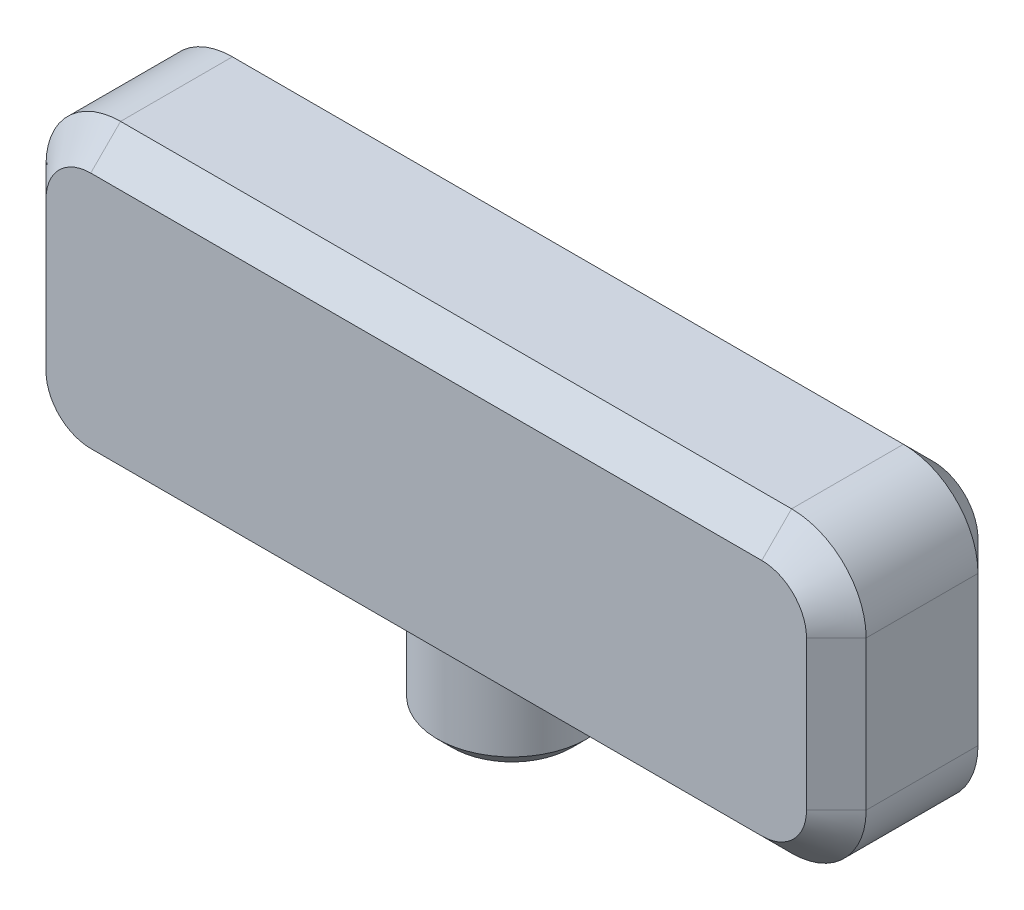
ISO-10303-21;
HEADER;
FILE_DESCRIPTION(('STEP AP214'),'2;1');
FILE_NAME('part.step','',(''),(''),'','','');
FILE_SCHEMA(('AUTOMOTIVE_DESIGN { 1 0 10303 214 1 1 1 1 }'));
ENDSEC;
DATA;
#1=APPLICATION_CONTEXT('core data for automotive mechanical design processes');
#2=APPLICATION_PROTOCOL_DEFINITION('international standard','automotive_design',2000,#1);
#3=PRODUCT_CONTEXT('',#1,'mechanical');
#4=PRODUCT('Part','Part','',(#3));
#5=PRODUCT_RELATED_PRODUCT_CATEGORY('part','',(#4));
#6=PRODUCT_DEFINITION_FORMATION('','',#4);
#7=PRODUCT_DEFINITION_CONTEXT('part definition',#1,'design');
#8=PRODUCT_DEFINITION('design','',#6,#7);
#9=PRODUCT_DEFINITION_SHAPE('','',#8);
#10=(LENGTH_UNIT() NAMED_UNIT(*) SI_UNIT(.MILLI.,.METRE.));
#11=(NAMED_UNIT(*) PLANE_ANGLE_UNIT() SI_UNIT($,.RADIAN.));
#12=(NAMED_UNIT(*) SI_UNIT($,.STERADIAN.) SOLID_ANGLE_UNIT());
#13=UNCERTAINTY_MEASURE_WITH_UNIT(LENGTH_MEASURE(1.E-05),#10,'distance_accuracy_value','');
#14=(GEOMETRIC_REPRESENTATION_CONTEXT(3) GLOBAL_UNCERTAINTY_ASSIGNED_CONTEXT((#13)) GLOBAL_UNIT_ASSIGNED_CONTEXT((#10,
#11,#12)) REPRESENTATION_CONTEXT('',''));
#15=CARTESIAN_POINT('',(0.,0.,0.));
#16=DIRECTION('',(0.,0.,1.));
#17=DIRECTION('',(1.,0.,0.));
#18=AXIS2_PLACEMENT_3D('',#15,#16,#17);
#19=CARTESIAN_POINT('',(0.,-25.4,22.86));
#20=DIRECTION('',(0.,-1.,0.));
#21=DIRECTION('',(1.,0.,0.));
#22=AXIS2_PLACEMENT_3D('',#19,#20,#21);
#23=PLANE('',#22);
#24=CARTESIAN_POINT('',(0.,-25.4,14.605));
#25=DIRECTION('',(0.,-1.,0.));
#26=DIRECTION('',(1.,0.,0.));
#27=AXIS2_PLACEMENT_3D('',#24,#25,#26);
#28=CIRCLE('',#27,12.7);
#29=CARTESIAN_POINT('',(-8.40026041263012,-25.4,24.1299999999999));
#30=VERTEX_POINT('',#29);
#31=CARTESIAN_POINT('',(-8.40026041263009,-25.4,5.08000000000003));
#32=VERTEX_POINT('',#31);
#33=EDGE_CURVE('E36',#30,#32,#28,.T.);
#34=ORIENTED_EDGE('',*,*,#33,.F.);
#35=DIRECTION('',(-1.,0.,0.));
#36=VECTOR('',#35,1.);
#37=CARTESIAN_POINT('',(0.,-25.4,24.1299999999999));
#38=LINE('',#37,#36);
#39=CARTESIAN_POINT('',(-57.15,-25.4,24.1299999999999));
#40=VERTEX_POINT('',#39);
#41=EDGE_CURVE('E331',#30,#40,#38,.T.);
#42=ORIENTED_EDGE('',*,*,#41,.T.);
#43=DIRECTION('',(0.,0.,-1.));
#44=VECTOR('',#43,1.);
#45=CARTESIAN_POINT('',(-57.15,-25.4,22.86));
#46=LINE('',#45,#44);
#47=CARTESIAN_POINT('',(-57.15,-25.4,5.08000000000003));
#48=VERTEX_POINT('',#47);
#49=EDGE_CURVE('E413',#40,#48,#46,.T.);
#50=ORIENTED_EDGE('',*,*,#49,.T.);
#51=DIRECTION('',(1.,0.,0.));
#52=VECTOR('',#51,1.);
#53=CARTESIAN_POINT('',(57.15,-25.4,5.08000000000003));
#54=LINE('',#53,#52);
#55=EDGE_CURVE('E197',#48,#32,#54,.T.);
#56=ORIENTED_EDGE('',*,*,#55,.T.);
#57=EDGE_LOOP('',(#34,#42,#50,#56));
#58=FACE_BOUND('',#57,.T.);
#59=ADVANCED_FACE('F15',(#58),#23,.T.);
#60=CARTESIAN_POINT('',(-69.85,0.,22.86));
#61=DIRECTION('',(-1.,0.,0.));
#62=DIRECTION('',(0.,0.,1.));
#63=AXIS2_PLACEMENT_3D('',#60,#61,#62);
#64=PLANE('',#63);
#65=DIRECTION('',(0.,0.,-1.));
#66=VECTOR('',#65,1.);
#67=CARTESIAN_POINT('',(-69.85,-12.7,22.86));
#68=LINE('',#67,#66);
#69=CARTESIAN_POINT('',(-69.85,-12.7,5.08000000000003));
#70=VERTEX_POINT('',#69);
#71=CARTESIAN_POINT('',(-69.85,-12.7,24.1299999999999));
#72=VERTEX_POINT('',#71);
#73=EDGE_CURVE('E405',#70,#72,#68,.F.);
#74=ORIENTED_EDGE('',*,*,#73,.T.);
#75=DIRECTION('',(0.,1.,0.));
#76=VECTOR('',#75,1.);
#77=CARTESIAN_POINT('',(-69.85,0.,24.1299999999999));
#78=LINE('',#77,#76);
#79=CARTESIAN_POINT('',(-69.85,12.7,24.1299999999999));
#80=VERTEX_POINT('',#79);
#81=EDGE_CURVE('E318',#72,#80,#78,.T.);
#82=ORIENTED_EDGE('',*,*,#81,.T.);
#83=DIRECTION('',(0.,0.,-1.));
#84=VECTOR('',#83,1.);
#85=CARTESIAN_POINT('',(-69.85,12.7,0.));
#86=LINE('',#85,#84);
#87=CARTESIAN_POINT('',(-69.85,12.7,5.08000000000003));
#88=VERTEX_POINT('',#87);
#89=EDGE_CURVE('E409',#80,#88,#86,.T.);
#90=ORIENTED_EDGE('',*,*,#89,.T.);
#91=DIRECTION('',(0.,-1.,0.));
#92=VECTOR('',#91,1.);
#93=CARTESIAN_POINT('',(-69.85,-12.7,5.08000000000003));
#94=LINE('',#93,#92);
#95=EDGE_CURVE('E321',#88,#70,#94,.T.);
#96=ORIENTED_EDGE('',*,*,#95,.T.);
#97=EDGE_LOOP('',(#74,#82,#90,#96));
#98=FACE_BOUND('',#97,.T.);
#99=ADVANCED_FACE('F484',(#98),#64,.T.);
#100=CARTESIAN_POINT('',(8.40026041263009,-25.4,5.08000000000003));
#101=VERTEX_POINT('',#100);
#102=CARTESIAN_POINT('',(8.40026041263012,-25.4,24.1299999999999));
#103=VERTEX_POINT('',#102);
#104=EDGE_CURVE('E201',#101,#103,#28,.T.);
#105=ORIENTED_EDGE('',*,*,#104,.F.);
#106=CARTESIAN_POINT('',(57.15,-25.4,5.08000000000003));
#107=VERTEX_POINT('',#106);
#108=EDGE_CURVE('E184',#101,#107,#54,.T.);
#109=ORIENTED_EDGE('',*,*,#108,.T.);
#110=DIRECTION('',(0.,0.,-1.));
#111=VECTOR('',#110,1.);
#112=CARTESIAN_POINT('',(57.15,-25.4,29.21));
#113=LINE('',#112,#111);
#114=CARTESIAN_POINT('',(57.15,-25.4,24.1299999999999));
#115=VERTEX_POINT('',#114);
#116=EDGE_CURVE('E417',#107,#115,#113,.F.);
#117=ORIENTED_EDGE('',*,*,#116,.T.);
#118=EDGE_CURVE('E203',#115,#103,#38,.T.);
#119=ORIENTED_EDGE('',*,*,#118,.T.);
#120=EDGE_LOOP('',(#105,#109,#117,#119));
#121=FACE_BOUND('',#120,.T.);
#122=ADVANCED_FACE('F202',(#121),#23,.T.);
#123=CARTESIAN_POINT('',(69.85,0.,22.86));
#124=DIRECTION('',(-1.,0.,0.));
#125=DIRECTION('',(0.,-1.,0.));
#126=AXIS2_PLACEMENT_3D('',#123,#124,#125);
#127=PLANE('',#126);
#128=DIRECTION('',(0.,0.,-1.));
#129=VECTOR('',#128,1.);
#130=CARTESIAN_POINT('',(69.85,12.7,22.86));
#131=LINE('',#130,#129);
#132=CARTESIAN_POINT('',(69.85,12.7,5.08000000000003));
#133=VERTEX_POINT('',#132);
#134=CARTESIAN_POINT('',(69.85,12.7,24.1299999999999));
#135=VERTEX_POINT('',#134);
#136=EDGE_CURVE('E401',#133,#135,#131,.F.);
#137=ORIENTED_EDGE('',*,*,#136,.T.);
#138=DIRECTION('',(0.,-1.,0.));
#139=VECTOR('',#138,1.);
#140=CARTESIAN_POINT('',(69.85,-12.7,24.1299999999999));
#141=LINE('',#140,#139);
#142=CARTESIAN_POINT('',(69.85,-12.7,24.1299999999999));
#143=VERTEX_POINT('',#142);
#144=EDGE_CURVE('E339',#135,#143,#141,.T.);
#145=ORIENTED_EDGE('',*,*,#144,.T.);
#146=DIRECTION('',(0.,0.,-1.));
#147=VECTOR('',#146,1.);
#148=CARTESIAN_POINT('',(69.85,-12.7,0.));
#149=LINE('',#148,#147);
#150=CARTESIAN_POINT('',(69.85,-12.7,5.08000000000003));
#151=VERTEX_POINT('',#150);
#152=EDGE_CURVE('E397',#143,#151,#149,.T.);
#153=ORIENTED_EDGE('',*,*,#152,.T.);
#154=DIRECTION('',(0.,1.,0.));
#155=VECTOR('',#154,1.);
#156=CARTESIAN_POINT('',(69.85,0.,5.08000000000003));
#157=LINE('',#156,#155);
#158=EDGE_CURVE('E342',#151,#133,#157,.T.);
#159=ORIENTED_EDGE('',*,*,#158,.T.);
#160=EDGE_LOOP('',(#137,#145,#153,#159));
#161=FACE_BOUND('',#160,.T.);
#162=ADVANCED_FACE('F493',(#161),#127,.F.);
#163=CARTESIAN_POINT('',(0.,25.4,22.86));
#164=DIRECTION('',(0.,-1.,0.));
#165=DIRECTION('',(1.,0.,0.));
#166=AXIS2_PLACEMENT_3D('',#163,#164,#165);
#167=PLANE('',#166);
#168=DIRECTION('',(0.,0.,-1.));
#169=VECTOR('',#168,1.);
#170=CARTESIAN_POINT('',(-57.15,25.4,29.21));
#171=LINE('',#170,#169);
#172=CARTESIAN_POINT('',(-57.15,25.4,5.08000000000003));
#173=VERTEX_POINT('',#172);
#174=CARTESIAN_POINT('',(-57.15,25.4,24.1299999999999));
#175=VERTEX_POINT('',#174);
#176=EDGE_CURVE('E393',#173,#175,#171,.F.);
#177=ORIENTED_EDGE('',*,*,#176,.T.);
#178=DIRECTION('',(1.,0.,0.));
#179=VECTOR('',#178,1.);
#180=CARTESIAN_POINT('',(57.15,25.4,24.1299999999999));
#181=LINE('',#180,#179);
#182=CARTESIAN_POINT('',(57.15,25.4,24.1299999999999));
#183=VERTEX_POINT('',#182);
#184=EDGE_CURVE('E351',#175,#183,#181,.T.);
#185=ORIENTED_EDGE('',*,*,#184,.T.);
#186=DIRECTION('',(0.,0.,-1.));
#187=VECTOR('',#186,1.);
#188=CARTESIAN_POINT('',(57.15,25.4,22.86));
#189=LINE('',#188,#187);
#190=CARTESIAN_POINT('',(57.15,25.4,5.08000000000003));
#191=VERTEX_POINT('',#190);
#192=EDGE_CURVE('E389',#183,#191,#189,.T.);
#193=ORIENTED_EDGE('',*,*,#192,.T.);
#194=DIRECTION('',(-1.,0.,0.));
#195=VECTOR('',#194,1.);
#196=CARTESIAN_POINT('',(0.,25.4,5.08000000000003));
#197=LINE('',#196,#195);
#198=EDGE_CURVE('E354',#191,#173,#197,.T.);
#199=ORIENTED_EDGE('',*,*,#198,.T.);
#200=EDGE_LOOP('',(#177,#185,#193,#199));
#201=FACE_BOUND('',#200,.T.);
#202=ADVANCED_FACE('F497',(#201),#167,.F.);
#203=CARTESIAN_POINT('',(0.,0.,0.));
#204=DIRECTION('',(0.,0.,1.));
#205=DIRECTION('',(1.,0.,0.));
#206=AXIS2_PLACEMENT_3D('',#203,#204,#205);
#207=PLANE('',#206);
#208=CARTESIAN_POINT('',(57.15,-12.7,0.));
#209=DIRECTION('',(0.,0.,1.));
#210=DIRECTION('',(1.,0.,0.));
#211=AXIS2_PLACEMENT_3D('',#208,#209,#210);
#212=CIRCLE('',#211,7.61999999999998);
#213=CARTESIAN_POINT('',(64.77,-12.7,0.));
#214=VERTEX_POINT('',#213);
#215=CARTESIAN_POINT('',(57.15,-20.32,0.));
#216=VERTEX_POINT('',#215);
#217=EDGE_CURVE('E297',#214,#216,#212,.F.);
#218=ORIENTED_EDGE('',*,*,#217,.T.);
#219=DIRECTION('',(-1.,0.,0.));
#220=VECTOR('',#219,1.);
#221=CARTESIAN_POINT('',(-57.15,-20.32,0.));
#222=LINE('',#221,#220);
#223=CARTESIAN_POINT('',(-57.15,-20.32,0.));
#224=VERTEX_POINT('',#223);
#225=EDGE_CURVE('E233',#216,#224,#222,.T.);
#226=ORIENTED_EDGE('',*,*,#225,.T.);
#227=CARTESIAN_POINT('',(-57.15,-12.7,0.));
#228=DIRECTION('',(0.,0.,1.));
#229=DIRECTION('',(1.,0.,0.));
#230=AXIS2_PLACEMENT_3D('',#227,#228,#229);
#231=CIRCLE('',#230,7.61999999999999);
#232=CARTESIAN_POINT('',(-64.77,-12.7,0.));
#233=VERTEX_POINT('',#232);
#234=EDGE_CURVE('E300',#224,#233,#231,.F.);
#235=ORIENTED_EDGE('',*,*,#234,.T.);
#236=DIRECTION('',(0.,1.,0.));
#237=VECTOR('',#236,1.);
#238=CARTESIAN_POINT('',(-64.77,12.7,0.));
#239=LINE('',#238,#237);
#240=CARTESIAN_POINT('',(-64.77,12.7,0.));
#241=VERTEX_POINT('',#240);
#242=EDGE_CURVE('E306',#233,#241,#239,.T.);
#243=ORIENTED_EDGE('',*,*,#242,.T.);
#244=CARTESIAN_POINT('',(-57.15,12.7,0.));
#245=DIRECTION('',(0.,0.,1.));
#246=DIRECTION('',(1.,0.,0.));
#247=AXIS2_PLACEMENT_3D('',#244,#245,#246);
#248=CIRCLE('',#247,7.61999999999998);
#249=CARTESIAN_POINT('',(-57.15,20.32,0.));
#250=VERTEX_POINT('',#249);
#251=EDGE_CURVE('E312',#241,#250,#248,.F.);
#252=ORIENTED_EDGE('',*,*,#251,.T.);
#253=DIRECTION('',(1.,0.,0.));
#254=VECTOR('',#253,1.);
#255=CARTESIAN_POINT('',(0.,20.32,0.));
#256=LINE('',#255,#254);
#257=CARTESIAN_POINT('',(57.15,20.32,0.));
#258=VERTEX_POINT('',#257);
#259=EDGE_CURVE('E315',#250,#258,#256,.T.);
#260=ORIENTED_EDGE('',*,*,#259,.T.);
#261=CARTESIAN_POINT('',(57.15,12.7,0.));
#262=DIRECTION('',(0.,0.,1.));
#263=DIRECTION('',(1.,0.,0.));
#264=AXIS2_PLACEMENT_3D('',#261,#262,#263);
#265=CIRCLE('',#264,7.61999999999998);
#266=CARTESIAN_POINT('',(64.77,12.7,0.));
#267=VERTEX_POINT('',#266);
#268=EDGE_CURVE('E309',#258,#267,#265,.F.);
#269=ORIENTED_EDGE('',*,*,#268,.T.);
#270=DIRECTION('',(0.,-1.,0.));
#271=VECTOR('',#270,1.);
#272=CARTESIAN_POINT('',(64.77,0.,0.));
#273=LINE('',#272,#271);
#274=EDGE_CURVE('E303',#267,#214,#273,.T.);
#275=ORIENTED_EDGE('',*,*,#274,.T.);
#276=EDGE_LOOP('',(#218,#226,#235,#243,#252,#260,#269,#275));
#277=FACE_BOUND('',#276,.T.);
#278=CARTESIAN_POINT('',(-44.45,0.,0.));
#279=DIRECTION('',(0.,0.,1.));
#280=DIRECTION('',(1.,0.,0.));
#281=AXIS2_PLACEMENT_3D('',#278,#279,#280);
#282=CIRCLE('',#281,13.335);
#283=CARTESIAN_POINT('',(-31.115,0.,0.));
#284=VERTEX_POINT('',#283);
#285=EDGE_CURVE('E268',#284,#284,#282,.T.);
#286=ORIENTED_EDGE('',*,*,#285,.T.);
#287=EDGE_LOOP('',(#286));
#288=FACE_BOUND('',#287,.T.);
#289=CARTESIAN_POINT('',(44.45,0.,0.));
#290=DIRECTION('',(0.,0.,1.));
#291=DIRECTION('',(1.,0.,0.));
#292=AXIS2_PLACEMENT_3D('',#289,#290,#291);
#293=CIRCLE('',#292,13.335);
#294=CARTESIAN_POINT('',(57.785,0.,0.));
#295=VERTEX_POINT('',#294);
#296=EDGE_CURVE('E420',#295,#295,#293,.T.);
#297=ORIENTED_EDGE('',*,*,#296,.T.);
#298=EDGE_LOOP('',(#297));
#299=FACE_BOUND('',#298,.T.);
#300=ADVANCED_FACE('F502',(#277,#288,#299),#207,.F.);
#301=CARTESIAN_POINT('',(0.,0.,29.21));
#302=DIRECTION('',(0.,0.,1.));
#303=DIRECTION('',(1.,0.,0.));
#304=AXIS2_PLACEMENT_3D('',#301,#302,#303);
#305=PLANE('',#304);
#306=DIRECTION('',(-1.,0.,0.));
#307=VECTOR('',#306,1.);
#308=CARTESIAN_POINT('',(-57.15,20.32,29.21));
#309=LINE('',#308,#307);
#310=CARTESIAN_POINT('',(57.15,20.32,29.21));
#311=VERTEX_POINT('',#310);
#312=CARTESIAN_POINT('',(-57.15,20.32,29.21));
#313=VERTEX_POINT('',#312);
#314=EDGE_CURVE('E368',#311,#313,#309,.T.);
#315=ORIENTED_EDGE('',*,*,#314,.T.);
#316=CARTESIAN_POINT('',(-57.15,12.7,29.21));
#317=DIRECTION('',(0.,0.,1.));
#318=DIRECTION('',(1.,0.,0.));
#319=AXIS2_PLACEMENT_3D('',#316,#317,#318);
#320=CIRCLE('',#319,7.61999999999997);
#321=CARTESIAN_POINT('',(-64.77,12.7,29.21));
#322=VERTEX_POINT('',#321);
#323=EDGE_CURVE('E364',#313,#322,#320,.T.);
#324=ORIENTED_EDGE('',*,*,#323,.T.);
#325=DIRECTION('',(0.,-1.,0.));
#326=VECTOR('',#325,1.);
#327=CARTESIAN_POINT('',(-64.77,0.,29.21));
#328=LINE('',#327,#326);
#329=CARTESIAN_POINT('',(-64.77,-12.7,29.21));
#330=VERTEX_POINT('',#329);
#331=EDGE_CURVE('E386',#322,#330,#328,.T.);
#332=ORIENTED_EDGE('',*,*,#331,.T.);
#333=CARTESIAN_POINT('',(-57.15,-12.7,29.21));
#334=DIRECTION('',(0.,0.,1.));
#335=DIRECTION('',(1.,0.,0.));
#336=AXIS2_PLACEMENT_3D('',#333,#334,#335);
#337=CIRCLE('',#336,7.61999999999997);
#338=CARTESIAN_POINT('',(-57.15,-20.32,29.21));
#339=VERTEX_POINT('',#338);
#340=EDGE_CURVE('E383',#330,#339,#337,.T.);
#341=ORIENTED_EDGE('',*,*,#340,.T.);
#342=DIRECTION('',(1.,0.,0.));
#343=VECTOR('',#342,1.);
#344=CARTESIAN_POINT('',(0.,-20.32,29.21));
#345=LINE('',#344,#343);
#346=CARTESIAN_POINT('',(57.15,-20.32,29.21));
#347=VERTEX_POINT('',#346);
#348=EDGE_CURVE('E380',#339,#347,#345,.T.);
#349=ORIENTED_EDGE('',*,*,#348,.T.);
#350=CARTESIAN_POINT('',(57.15,-12.7,29.21));
#351=DIRECTION('',(0.,0.,1.));
#352=DIRECTION('',(1.,0.,0.));
#353=AXIS2_PLACEMENT_3D('',#350,#351,#352);
#354=CIRCLE('',#353,7.61999999999997);
#355=CARTESIAN_POINT('',(64.7699999999999,-12.7,29.21));
#356=VERTEX_POINT('',#355);
#357=EDGE_CURVE('E377',#347,#356,#354,.T.);
#358=ORIENTED_EDGE('',*,*,#357,.T.);
#359=DIRECTION('',(0.,1.,0.));
#360=VECTOR('',#359,1.);
#361=CARTESIAN_POINT('',(64.7699999999999,12.7,29.21));
#362=LINE('',#361,#360);
#363=CARTESIAN_POINT('',(64.7699999999999,12.7,29.21));
#364=VERTEX_POINT('',#363);
#365=EDGE_CURVE('E374',#356,#364,#362,.T.);
#366=ORIENTED_EDGE('',*,*,#365,.T.);
#367=CARTESIAN_POINT('',(57.15,12.7,29.21));
#368=DIRECTION('',(0.,0.,1.));
#369=DIRECTION('',(1.,0.,0.));
#370=AXIS2_PLACEMENT_3D('',#367,#368,#369);
#371=CIRCLE('',#370,7.61999999999997);
#372=EDGE_CURVE('E371',#364,#311,#371,.T.);
#373=ORIENTED_EDGE('',*,*,#372,.T.);
#374=EDGE_LOOP('',(#315,#324,#332,#341,#349,#358,#366,#373));
#375=FACE_BOUND('',#374,.T.);
#376=ADVANCED_FACE('F508',(#375),#305,.T.);
#377=CARTESIAN_POINT('',(44.45,0.,-7.62000000000002));
#378=DIRECTION('',(0.,0.,1.));
#379=DIRECTION('',(1.,0.,0.));
#380=AXIS2_PLACEMENT_3D('',#377,#378,#379);
#381=CYLINDRICAL_SURFACE('',#380,13.335);
#382=CARTESIAN_POINT('',(44.45,0.,-5.07999999999992));
#383=DIRECTION('',(0.,0.,1.));
#384=DIRECTION('',(1.,0.,0.));
#385=AXIS2_PLACEMENT_3D('',#382,#383,#384);
#386=CIRCLE('',#385,13.335);
#387=CARTESIAN_POINT('',(57.785,0.,-5.07999999999992));
#388=VERTEX_POINT('',#387);
#389=EDGE_CURVE('E229',#388,#388,#386,.T.);
#390=ORIENTED_EDGE('',*,*,#389,.T.);
#391=EDGE_LOOP('',(#390));
#392=FACE_BOUND('',#391,.T.);
#393=ORIENTED_EDGE('',*,*,#296,.F.);
#394=EDGE_LOOP('',(#393));
#395=FACE_BOUND('',#394,.T.);
#396=ADVANCED_FACE('F512',(#392,#395),#381,.T.);
#397=CARTESIAN_POINT('',(44.45,0.,-7.62000000000002));
#398=DIRECTION('',(0.,0.,1.));
#399=DIRECTION('',(1.,0.,0.));
#400=AXIS2_PLACEMENT_3D('',#397,#398,#399);
#401=PLANE('',#400);
#402=CARTESIAN_POINT('',(44.45,0.,-7.62000000000002));
#403=DIRECTION('',(0.,0.,1.));
#404=DIRECTION('',(1.,0.,0.));
#405=AXIS2_PLACEMENT_3D('',#402,#403,#404);
#406=CIRCLE('',#405,8.25499999999999);
#407=CARTESIAN_POINT('',(52.705,0.,-7.62000000000002));
#408=VERTEX_POINT('',#407);
#409=EDGE_CURVE('E442',#408,#408,#406,.T.);
#410=ORIENTED_EDGE('',*,*,#409,.T.);
#411=EDGE_LOOP('',(#410));
#412=FACE_BOUND('',#411,.T.);
#413=CARTESIAN_POINT('',(44.45,0.,-7.62000000000002));
#414=DIRECTION('',(0.,0.,1.));
#415=DIRECTION('',(1.,0.,0.));
#416=AXIS2_PLACEMENT_3D('',#413,#414,#415);
#417=CIRCLE('',#416,10.7949999999999);
#418=CARTESIAN_POINT('',(55.2449999999999,0.,-7.62000000000002));
#419=VERTEX_POINT('',#418);
#420=EDGE_CURVE('E225',#419,#419,#417,.F.);
#421=ORIENTED_EDGE('',*,*,#420,.T.);
#422=EDGE_LOOP('',(#421));
#423=FACE_BOUND('',#422,.T.);
#424=ADVANCED_FACE('F463',(#412,#423),#401,.F.);
#425=CARTESIAN_POINT('',(-44.45,0.,-7.62000000000002));
#426=DIRECTION('',(0.,0.,1.));
#427=DIRECTION('',(1.,0.,0.));
#428=AXIS2_PLACEMENT_3D('',#425,#426,#427);
#429=CYLINDRICAL_SURFACE('',#428,13.335);
#430=CARTESIAN_POINT('',(-44.45,0.,-5.07999999999992));
#431=DIRECTION('',(0.,0.,1.));
#432=DIRECTION('',(1.,0.,0.));
#433=AXIS2_PLACEMENT_3D('',#430,#431,#432);
#434=CIRCLE('',#433,13.335);
#435=CARTESIAN_POINT('',(-31.115,0.,-5.07999999999992));
#436=VERTEX_POINT('',#435);
#437=EDGE_CURVE('E219',#436,#436,#434,.T.);
#438=ORIENTED_EDGE('',*,*,#437,.T.);
#439=EDGE_LOOP('',(#438));
#440=FACE_BOUND('',#439,.T.);
#441=ORIENTED_EDGE('',*,*,#285,.F.);
#442=EDGE_LOOP('',(#441));
#443=FACE_BOUND('',#442,.T.);
#444=ADVANCED_FACE('F519',(#440,#443),#429,.T.);
#445=CARTESIAN_POINT('',(-44.45,0.,-7.62000000000002));
#446=DIRECTION('',(0.,0.,1.));
#447=DIRECTION('',(1.,0.,0.));
#448=AXIS2_PLACEMENT_3D('',#445,#446,#447);
#449=PLANE('',#448);
#450=CARTESIAN_POINT('',(-44.45,0.,-7.62000000000002));
#451=DIRECTION('',(0.,0.,1.));
#452=DIRECTION('',(1.,0.,0.));
#453=AXIS2_PLACEMENT_3D('',#450,#451,#452);
#454=CIRCLE('',#453,8.25499999999999);
#455=CARTESIAN_POINT('',(-36.195,0.,-7.62000000000002));
#456=VERTEX_POINT('',#455);
#457=EDGE_CURVE('E433',#456,#456,#454,.T.);
#458=ORIENTED_EDGE('',*,*,#457,.T.);
#459=EDGE_LOOP('',(#458));
#460=FACE_BOUND('',#459,.T.);
#461=CARTESIAN_POINT('',(-44.45,0.,-7.62000000000002));
#462=DIRECTION('',(0.,0.,1.));
#463=DIRECTION('',(1.,0.,0.));
#464=AXIS2_PLACEMENT_3D('',#461,#462,#463);
#465=CIRCLE('',#464,10.7949999999999);
#466=CARTESIAN_POINT('',(-33.6550000000001,0.,-7.62000000000002));
#467=VERTEX_POINT('',#466);
#468=EDGE_CURVE('E210',#467,#467,#465,.F.);
#469=ORIENTED_EDGE('',*,*,#468,.T.);
#470=EDGE_LOOP('',(#469));
#471=FACE_BOUND('',#470,.T.);
#472=ADVANCED_FACE('F520',(#460,#471),#449,.F.);
#473=CARTESIAN_POINT('',(-57.15,-12.7,22.86));
#474=DIRECTION('',(0.,0.,-1.));
#475=DIRECTION('',(-1.,0.,0.));
#476=AXIS2_PLACEMENT_3D('',#473,#474,#475);
#477=CYLINDRICAL_SURFACE('',#476,12.7);
#478=ORIENTED_EDGE('',*,*,#49,.F.);
#479=CARTESIAN_POINT('',(-57.15,-12.7,24.1299999999999));
#480=DIRECTION('',(0.,0.,1.));
#481=DIRECTION('',(1.,0.,0.));
#482=AXIS2_PLACEMENT_3D('',#479,#480,#481);
#483=CIRCLE('',#482,12.7);
#484=EDGE_CURVE('E324',#40,#72,#483,.F.);
#485=ORIENTED_EDGE('',*,*,#484,.T.);
#486=ORIENTED_EDGE('',*,*,#73,.F.);
#487=CARTESIAN_POINT('',(-57.15,-12.7,5.08000000000003));
#488=DIRECTION('',(0.,0.,1.));
#489=DIRECTION('',(1.,0.,0.));
#490=AXIS2_PLACEMENT_3D('',#487,#488,#489);
#491=CIRCLE('',#490,12.7);
#492=EDGE_CURVE('E327',#70,#48,#491,.T.);
#493=ORIENTED_EDGE('',*,*,#492,.T.);
#494=EDGE_LOOP('',(#478,#485,#486,#493));
#495=FACE_BOUND('',#494,.T.);
#496=ADVANCED_FACE('F523',(#495),#477,.T.);
#497=CARTESIAN_POINT('',(57.15,-12.7,22.86));
#498=DIRECTION('',(0.,0.,1.));
#499=DIRECTION('',(1.,0.,0.));
#500=AXIS2_PLACEMENT_3D('',#497,#498,#499);
#501=CYLINDRICAL_SURFACE('',#500,12.7);
#502=ORIENTED_EDGE('',*,*,#152,.F.);
#503=CARTESIAN_POINT('',(57.15,-12.7,24.1299999999999));
#504=DIRECTION('',(0.,0.,1.));
#505=DIRECTION('',(1.,0.,0.));
#506=AXIS2_PLACEMENT_3D('',#503,#504,#505);
#507=CIRCLE('',#506,12.7);
#508=EDGE_CURVE('E198',#143,#115,#507,.F.);
#509=ORIENTED_EDGE('',*,*,#508,.T.);
#510=ORIENTED_EDGE('',*,*,#116,.F.);
#511=CARTESIAN_POINT('',(57.15,-12.7,5.08000000000003));
#512=DIRECTION('',(0.,0.,1.));
#513=DIRECTION('',(1.,0.,0.));
#514=AXIS2_PLACEMENT_3D('',#511,#512,#513);
#515=CIRCLE('',#514,12.7);
#516=EDGE_CURVE('E336',#107,#151,#515,.T.);
#517=ORIENTED_EDGE('',*,*,#516,.T.);
#518=EDGE_LOOP('',(#502,#509,#510,#517));
#519=FACE_BOUND('',#518,.T.);
#520=ADVANCED_FACE('F648',(#519),#501,.T.);
#521=CARTESIAN_POINT('',(57.15,12.7,22.86));
#522=DIRECTION('',(0.,0.,-1.));
#523=DIRECTION('',(-1.,0.,0.));
#524=AXIS2_PLACEMENT_3D('',#521,#522,#523);
#525=CYLINDRICAL_SURFACE('',#524,12.7);
#526=ORIENTED_EDGE('',*,*,#192,.F.);
#527=CARTESIAN_POINT('',(57.15,12.7,24.1299999999999));
#528=DIRECTION('',(0.,0.,1.));
#529=DIRECTION('',(1.,0.,0.));
#530=AXIS2_PLACEMENT_3D('',#527,#528,#529);
#531=CIRCLE('',#530,12.7);
#532=EDGE_CURVE('E345',#183,#135,#531,.F.);
#533=ORIENTED_EDGE('',*,*,#532,.T.);
#534=ORIENTED_EDGE('',*,*,#136,.F.);
#535=CARTESIAN_POINT('',(57.15,12.7,5.08000000000003));
#536=DIRECTION('',(0.,0.,1.));
#537=DIRECTION('',(1.,0.,0.));
#538=AXIS2_PLACEMENT_3D('',#535,#536,#537);
#539=CIRCLE('',#538,12.7);
#540=EDGE_CURVE('E348',#133,#191,#539,.T.);
#541=ORIENTED_EDGE('',*,*,#540,.T.);
#542=EDGE_LOOP('',(#526,#533,#534,#541));
#543=FACE_BOUND('',#542,.T.);
#544=ADVANCED_FACE('F644',(#543),#525,.T.);
#545=CARTESIAN_POINT('',(-57.15,12.7,22.86));
#546=DIRECTION('',(0.,0.,1.));
#547=DIRECTION('',(1.,0.,0.));
#548=AXIS2_PLACEMENT_3D('',#545,#546,#547);
#549=CYLINDRICAL_SURFACE('',#548,12.7);
#550=ORIENTED_EDGE('',*,*,#89,.F.);
#551=CARTESIAN_POINT('',(-57.15,12.7,24.1299999999999));
#552=DIRECTION('',(0.,0.,1.));
#553=DIRECTION('',(1.,0.,0.));
#554=AXIS2_PLACEMENT_3D('',#551,#552,#553);
#555=CIRCLE('',#554,12.7);
#556=EDGE_CURVE('E357',#80,#175,#555,.F.);
#557=ORIENTED_EDGE('',*,*,#556,.T.);
#558=ORIENTED_EDGE('',*,*,#176,.F.);
#559=CARTESIAN_POINT('',(-57.15,12.7,5.08000000000003));
#560=DIRECTION('',(0.,0.,1.));
#561=DIRECTION('',(1.,0.,0.));
#562=AXIS2_PLACEMENT_3D('',#559,#560,#561);
#563=CIRCLE('',#562,12.7);
#564=EDGE_CURVE('E361',#173,#88,#563,.T.);
#565=ORIENTED_EDGE('',*,*,#564,.T.);
#566=EDGE_LOOP('',(#550,#557,#558,#565));
#567=FACE_BOUND('',#566,.T.);
#568=ADVANCED_FACE('F615',(#567),#549,.T.);
#569=CARTESIAN_POINT('',(57.15,-12.7,29.21));
#570=DIRECTION('',(0.,0.,-1.));
#571=DIRECTION('',(-1.,0.,0.));
#572=AXIS2_PLACEMENT_3D('',#569,#570,#571);
#573=CONICAL_SURFACE('',#572,7.61999999999997,0.785398163397447);
#574=DIRECTION('',(0.,0.707106781186546,0.707106781186549));
#575=VECTOR('',#574,1.);
#576=CARTESIAN_POINT('',(57.15,-25.4,24.1299999999999));
#577=LINE('',#576,#575);
#578=EDGE_CURVE('E269',#115,#347,#577,.T.);
#579=ORIENTED_EDGE('',*,*,#578,.F.);
#580=ORIENTED_EDGE('',*,*,#508,.F.);
#581=DIRECTION('',(0.707106781186547,0.,-0.707106781186549));
#582=VECTOR('',#581,1.);
#583=CARTESIAN_POINT('',(64.7699999999999,-12.7,29.21));
#584=LINE('',#583,#582);
#585=EDGE_CURVE('E264',#356,#143,#584,.T.);
#586=ORIENTED_EDGE('',*,*,#585,.F.);
#587=ORIENTED_EDGE('',*,*,#357,.F.);
#588=EDGE_LOOP('',(#579,#580,#586,#587));
#589=FACE_BOUND('',#588,.T.);
#590=ADVANCED_FACE('F611',(#589),#573,.T.);
#591=CARTESIAN_POINT('',(69.85,0.,24.1299999999999));
#592=DIRECTION('',(0.707106781186549,0.,0.707106781186547));
#593=DIRECTION('',(0.,1.,0.));
#594=AXIS2_PLACEMENT_3D('',#591,#592,#593);
#595=PLANE('',#594);
#596=ORIENTED_EDGE('',*,*,#585,.T.);
#597=ORIENTED_EDGE('',*,*,#144,.F.);
#598=DIRECTION('',(0.707106781186547,0.,-0.707106781186549));
#599=VECTOR('',#598,1.);
#600=CARTESIAN_POINT('',(64.7699999999999,12.7,29.21));
#601=LINE('',#600,#599);
#602=EDGE_CURVE('E273',#364,#135,#601,.T.);
#603=ORIENTED_EDGE('',*,*,#602,.F.);
#604=ORIENTED_EDGE('',*,*,#365,.F.);
#605=EDGE_LOOP('',(#596,#597,#603,#604));
#606=FACE_BOUND('',#605,.T.);
#607=ADVANCED_FACE('F614',(#606),#595,.T.);
#608=CARTESIAN_POINT('',(0.,-20.32,29.21));
#609=DIRECTION('',(0.,0.707106781186549,-0.707106781186547));
#610=DIRECTION('',(1.,0.,0.));
#611=AXIS2_PLACEMENT_3D('',#608,#609,#610);
#612=PLANE('',#611);
#613=CARTESIAN_POINT('',(0.,-34.9249999999999,14.605));
#614=DIRECTION('',(0.,0.707106781186549,-0.707106781186547));
#615=DIRECTION('',(0.,-0.707106781186547,-0.707106781186549));
#616=AXIS2_PLACEMENT_3D('',#613,#614,#615);
#617=ELLIPSE('',#616,17.9605122421383,12.7);
#618=EDGE_CURVE('E45',#103,#30,#617,.F.);
#619=ORIENTED_EDGE('',*,*,#618,.F.);
#620=ORIENTED_EDGE('',*,*,#118,.F.);
#621=ORIENTED_EDGE('',*,*,#578,.T.);
#622=ORIENTED_EDGE('',*,*,#348,.F.);
#623=DIRECTION('',(0.,0.707106781186547,0.707106781186548));
#624=VECTOR('',#623,1.);
#625=CARTESIAN_POINT('',(-57.15,-25.4,24.1299999999999));
#626=LINE('',#625,#624);
#627=EDGE_CURVE('E277',#40,#339,#626,.T.);
#628=ORIENTED_EDGE('',*,*,#627,.F.);
#629=ORIENTED_EDGE('',*,*,#41,.F.);
#630=EDGE_LOOP('',(#619,#620,#621,#622,#628,#629));
#631=FACE_BOUND('',#630,.T.);
#632=ADVANCED_FACE('F619',(#631),#612,.F.);
#633=CARTESIAN_POINT('',(57.15,12.7,29.21));
#634=DIRECTION('',(0.,0.,-1.));
#635=DIRECTION('',(-1.,0.,0.));
#636=AXIS2_PLACEMENT_3D('',#633,#634,#635);
#637=CONICAL_SURFACE('',#636,7.61999999999997,0.785398163397447);
#638=ORIENTED_EDGE('',*,*,#602,.T.);
#639=ORIENTED_EDGE('',*,*,#532,.F.);
#640=DIRECTION('',(0.,0.707106781186547,-0.707106781186548));
#641=VECTOR('',#640,1.);
#642=CARTESIAN_POINT('',(57.15,20.32,29.21));
#643=LINE('',#642,#641);
#644=EDGE_CURVE('E281',#311,#183,#643,.T.);
#645=ORIENTED_EDGE('',*,*,#644,.F.);
#646=ORIENTED_EDGE('',*,*,#372,.F.);
#647=EDGE_LOOP('',(#638,#639,#645,#646));
#648=FACE_BOUND('',#647,.T.);
#649=ADVANCED_FACE('F623',(#648),#637,.T.);
#650=CARTESIAN_POINT('',(-57.15,-12.7,29.21));
#651=DIRECTION('',(0.,0.,-1.));
#652=DIRECTION('',(-1.,0.,0.));
#653=AXIS2_PLACEMENT_3D('',#650,#651,#652);
#654=CONICAL_SURFACE('',#653,7.61999999999997,0.785398163397447);
#655=ORIENTED_EDGE('',*,*,#627,.T.);
#656=ORIENTED_EDGE('',*,*,#340,.F.);
#657=DIRECTION('',(0.707106781186547,0.,0.707106781186549));
#658=VECTOR('',#657,1.);
#659=CARTESIAN_POINT('',(-69.85,-12.7,24.1299999999999));
#660=LINE('',#659,#658);
#661=EDGE_CURVE('E285',#72,#330,#660,.T.);
#662=ORIENTED_EDGE('',*,*,#661,.F.);
#663=ORIENTED_EDGE('',*,*,#484,.F.);
#664=EDGE_LOOP('',(#655,#656,#662,#663));
#665=FACE_BOUND('',#664,.T.);
#666=ADVANCED_FACE('F626',(#665),#654,.T.);
#667=CARTESIAN_POINT('',(0.,25.4,24.1299999999999));
#668=DIRECTION('',(0.,0.707106781186549,0.707106781186547));
#669=DIRECTION('',(-1.,0.,0.));
#670=AXIS2_PLACEMENT_3D('',#667,#668,#669);
#671=PLANE('',#670);
#672=ORIENTED_EDGE('',*,*,#644,.T.);
#673=ORIENTED_EDGE('',*,*,#184,.F.);
#674=DIRECTION('',(0.,0.707106781186547,-0.707106781186549));
#675=VECTOR('',#674,1.);
#676=CARTESIAN_POINT('',(-57.15,20.32,29.21));
#677=LINE('',#676,#675);
#678=EDGE_CURVE('E289',#313,#175,#677,.T.);
#679=ORIENTED_EDGE('',*,*,#678,.F.);
#680=ORIENTED_EDGE('',*,*,#314,.F.);
#681=EDGE_LOOP('',(#672,#673,#679,#680));
#682=FACE_BOUND('',#681,.T.);
#683=ADVANCED_FACE('F630',(#682),#671,.T.);
#684=CARTESIAN_POINT('',(-64.77,0.,29.21));
#685=DIRECTION('',(0.707106781186549,0.,-0.707106781186547));
#686=DIRECTION('',(0.,-1.,0.));
#687=AXIS2_PLACEMENT_3D('',#684,#685,#686);
#688=PLANE('',#687);
#689=ORIENTED_EDGE('',*,*,#661,.T.);
#690=ORIENTED_EDGE('',*,*,#331,.F.);
#691=DIRECTION('',(0.707106781186547,0.,0.707106781186549));
#692=VECTOR('',#691,1.);
#693=CARTESIAN_POINT('',(-69.85,12.7,24.1299999999999));
#694=LINE('',#693,#692);
#695=EDGE_CURVE('E238',#80,#322,#694,.T.);
#696=ORIENTED_EDGE('',*,*,#695,.F.);
#697=ORIENTED_EDGE('',*,*,#81,.F.);
#698=EDGE_LOOP('',(#689,#690,#696,#697));
#699=FACE_BOUND('',#698,.T.);
#700=ADVANCED_FACE('F634',(#699),#688,.F.);
#701=CARTESIAN_POINT('',(-57.15,12.7,29.21));
#702=DIRECTION('',(0.,0.,-1.));
#703=DIRECTION('',(-1.,0.,0.));
#704=AXIS2_PLACEMENT_3D('',#701,#702,#703);
#705=CONICAL_SURFACE('',#704,7.61999999999997,0.785398163397447);
#706=ORIENTED_EDGE('',*,*,#678,.T.);
#707=ORIENTED_EDGE('',*,*,#556,.F.);
#708=ORIENTED_EDGE('',*,*,#695,.T.);
#709=ORIENTED_EDGE('',*,*,#323,.F.);
#710=EDGE_LOOP('',(#706,#707,#708,#709));
#711=FACE_BOUND('',#710,.T.);
#712=ADVANCED_FACE('F584',(#711),#705,.T.);
#713=CARTESIAN_POINT('',(0.,25.4,5.08000000000003));
#714=DIRECTION('',(0.,-0.707106781186547,0.707106781186548));
#715=DIRECTION('',(-1.,0.,0.));
#716=AXIS2_PLACEMENT_3D('',#713,#714,#715);
#717=PLANE('',#716);
#718=DIRECTION('',(0.,-0.707106781186549,-0.707106781186546));
#719=VECTOR('',#718,1.);
#720=CARTESIAN_POINT('',(-57.15,25.4,5.08000000000003));
#721=LINE('',#720,#719);
#722=EDGE_CURVE('E239',#173,#250,#721,.T.);
#723=ORIENTED_EDGE('',*,*,#722,.F.);
#724=ORIENTED_EDGE('',*,*,#198,.F.);
#725=DIRECTION('',(0.,0.707106781186548,0.707106781186547));
#726=VECTOR('',#725,1.);
#727=CARTESIAN_POINT('',(57.15,20.32,0.));
#728=LINE('',#727,#726);
#729=EDGE_CURVE('E234',#258,#191,#728,.T.);
#730=ORIENTED_EDGE('',*,*,#729,.F.);
#731=ORIENTED_EDGE('',*,*,#259,.F.);
#732=EDGE_LOOP('',(#723,#724,#730,#731));
#733=FACE_BOUND('',#732,.T.);
#734=ADVANCED_FACE('F580',(#733),#717,.F.);
#735=CARTESIAN_POINT('',(57.15,12.7,0.));
#736=DIRECTION('',(0.,0.,1.));
#737=DIRECTION('',(1.,0.,0.));
#738=AXIS2_PLACEMENT_3D('',#735,#736,#737);
#739=CONICAL_SURFACE('',#738,7.61999999999998,0.78539816339745);
#740=ORIENTED_EDGE('',*,*,#729,.T.);
#741=ORIENTED_EDGE('',*,*,#540,.F.);
#742=DIRECTION('',(0.707106781186548,0.,0.707106781186547));
#743=VECTOR('',#742,1.);
#744=CARTESIAN_POINT('',(64.77,12.7,0.));
#745=LINE('',#744,#743);
#746=EDGE_CURVE('E243',#267,#133,#745,.T.);
#747=ORIENTED_EDGE('',*,*,#746,.F.);
#748=ORIENTED_EDGE('',*,*,#268,.F.);
#749=EDGE_LOOP('',(#740,#741,#747,#748));
#750=FACE_BOUND('',#749,.T.);
#751=ADVANCED_FACE('F583',(#750),#739,.T.);
#752=CARTESIAN_POINT('',(-57.15,12.7,0.));
#753=DIRECTION('',(0.,0.,1.));
#754=DIRECTION('',(1.,0.,0.));
#755=AXIS2_PLACEMENT_3D('',#752,#753,#754);
#756=CONICAL_SURFACE('',#755,7.61999999999998,0.78539816339745);
#757=ORIENTED_EDGE('',*,*,#722,.T.);
#758=ORIENTED_EDGE('',*,*,#251,.F.);
#759=DIRECTION('',(0.707106781186548,0.,-0.707106781186547));
#760=VECTOR('',#759,1.);
#761=CARTESIAN_POINT('',(-69.85,12.7,5.08000000000003));
#762=LINE('',#761,#760);
#763=EDGE_CURVE('E247',#88,#241,#762,.T.);
#764=ORIENTED_EDGE('',*,*,#763,.F.);
#765=ORIENTED_EDGE('',*,*,#564,.F.);
#766=EDGE_LOOP('',(#757,#758,#764,#765));
#767=FACE_BOUND('',#766,.T.);
#768=ADVANCED_FACE('F588',(#767),#756,.T.);
#769=CARTESIAN_POINT('',(69.85,0.,5.08000000000003));
#770=DIRECTION('',(-0.707106781186547,0.,0.707106781186548));
#771=DIRECTION('',(0.,1.,0.));
#772=AXIS2_PLACEMENT_3D('',#769,#770,#771);
#773=PLANE('',#772);
#774=ORIENTED_EDGE('',*,*,#746,.T.);
#775=ORIENTED_EDGE('',*,*,#158,.F.);
#776=DIRECTION('',(0.707106781186548,0.,0.707106781186547));
#777=VECTOR('',#776,1.);
#778=CARTESIAN_POINT('',(64.77,-12.7,0.));
#779=LINE('',#778,#777);
#780=EDGE_CURVE('E251',#214,#151,#779,.T.);
#781=ORIENTED_EDGE('',*,*,#780,.F.);
#782=ORIENTED_EDGE('',*,*,#274,.F.);
#783=EDGE_LOOP('',(#774,#775,#781,#782));
#784=FACE_BOUND('',#783,.T.);
#785=ADVANCED_FACE('F592',(#784),#773,.F.);
#786=CARTESIAN_POINT('',(-64.77,0.,0.));
#787=DIRECTION('',(-0.707106781186547,0.,-0.707106781186548));
#788=DIRECTION('',(0.,-1.,0.));
#789=AXIS2_PLACEMENT_3D('',#786,#787,#788);
#790=PLANE('',#789);
#791=ORIENTED_EDGE('',*,*,#763,.T.);
#792=ORIENTED_EDGE('',*,*,#242,.F.);
#793=DIRECTION('',(0.707106781186548,0.,-0.707106781186547));
#794=VECTOR('',#793,1.);
#795=CARTESIAN_POINT('',(-69.85,-12.7,5.08000000000003));
#796=LINE('',#795,#794);
#797=EDGE_CURVE('E255',#70,#233,#796,.T.);
#798=ORIENTED_EDGE('',*,*,#797,.F.);
#799=ORIENTED_EDGE('',*,*,#95,.F.);
#800=EDGE_LOOP('',(#791,#792,#798,#799));
#801=FACE_BOUND('',#800,.T.);
#802=ADVANCED_FACE('F596',(#801),#790,.T.);
#803=CARTESIAN_POINT('',(57.15,-12.7,0.));
#804=DIRECTION('',(0.,0.,1.));
#805=DIRECTION('',(1.,0.,0.));
#806=AXIS2_PLACEMENT_3D('',#803,#804,#805);
#807=CONICAL_SURFACE('',#806,7.61999999999998,0.78539816339745);
#808=ORIENTED_EDGE('',*,*,#780,.T.);
#809=ORIENTED_EDGE('',*,*,#516,.F.);
#810=DIRECTION('',(0.,-0.707106781186548,0.707106781186547));
#811=VECTOR('',#810,1.);
#812=CARTESIAN_POINT('',(57.15,-20.32,0.));
#813=LINE('',#812,#811);
#814=EDGE_CURVE('E192',#216,#107,#813,.T.);
#815=ORIENTED_EDGE('',*,*,#814,.F.);
#816=ORIENTED_EDGE('',*,*,#217,.F.);
#817=EDGE_LOOP('',(#808,#809,#815,#816));
#818=FACE_BOUND('',#817,.T.);
#819=ADVANCED_FACE('F600',(#818),#807,.T.);
#820=CARTESIAN_POINT('',(-57.15,-12.7,0.));
#821=DIRECTION('',(0.,0.,1.));
#822=DIRECTION('',(1.,0.,0.));
#823=AXIS2_PLACEMENT_3D('',#820,#821,#822);
#824=CONICAL_SURFACE('',#823,7.61999999999999,0.78539816339745);
#825=ORIENTED_EDGE('',*,*,#797,.T.);
#826=ORIENTED_EDGE('',*,*,#234,.F.);
#827=DIRECTION('',(0.,0.707106781186549,-0.707106781186547));
#828=VECTOR('',#827,1.);
#829=CARTESIAN_POINT('',(-57.15,-25.4,5.08000000000003));
#830=LINE('',#829,#828);
#831=EDGE_CURVE('E261',#48,#224,#830,.T.);
#832=ORIENTED_EDGE('',*,*,#831,.F.);
#833=ORIENTED_EDGE('',*,*,#492,.F.);
#834=EDGE_LOOP('',(#825,#826,#832,#833));
#835=FACE_BOUND('',#834,.T.);
#836=ADVANCED_FACE('F604',(#835),#824,.T.);
#837=CARTESIAN_POINT('',(0.,-20.32,0.));
#838=DIRECTION('',(0.,-0.707106781186547,-0.707106781186548));
#839=DIRECTION('',(1.,0.,0.));
#840=AXIS2_PLACEMENT_3D('',#837,#838,#839);
#841=PLANE('',#840);
#842=CARTESIAN_POINT('',(0.,-34.925,14.605));
#843=DIRECTION('',(0.,-0.707106781186547,-0.707106781186548));
#844=DIRECTION('',(0.,-0.707106781186548,0.707106781186547));
#845=AXIS2_PLACEMENT_3D('',#842,#843,#844);
#846=ELLIPSE('',#845,17.9605122421383,12.7);
#847=EDGE_CURVE('E189',#32,#101,#846,.T.);
#848=ORIENTED_EDGE('',*,*,#847,.F.);
#849=ORIENTED_EDGE('',*,*,#55,.F.);
#850=ORIENTED_EDGE('',*,*,#831,.T.);
#851=ORIENTED_EDGE('',*,*,#225,.F.);
#852=ORIENTED_EDGE('',*,*,#814,.T.);
#853=ORIENTED_EDGE('',*,*,#108,.F.);
#854=EDGE_LOOP('',(#848,#849,#850,#851,#852,#853));
#855=FACE_BOUND('',#854,.T.);
#856=ADVANCED_FACE('F186',(#855),#841,.T.);
#857=CARTESIAN_POINT('',(44.45,0.,-5.07999999999992));
#858=DIRECTION('',(0.,0.,1.));
#859=DIRECTION('',(1.,0.,0.));
#860=AXIS2_PLACEMENT_3D('',#857,#858,#859);
#861=CONICAL_SURFACE('',#860,13.335,0.785398163397449);
#862=ORIENTED_EDGE('',*,*,#420,.F.);
#863=EDGE_LOOP('',(#862));
#864=FACE_BOUND('',#863,.T.);
#865=ORIENTED_EDGE('',*,*,#389,.F.);
#866=EDGE_LOOP('',(#865));
#867=FACE_BOUND('',#866,.T.);
#868=ADVANCED_FACE('F566',(#864,#867),#861,.T.);
#869=CARTESIAN_POINT('',(-44.45,0.,-5.07999999999992));
#870=DIRECTION('',(0.,0.,1.));
#871=DIRECTION('',(1.,0.,0.));
#872=AXIS2_PLACEMENT_3D('',#869,#870,#871);
#873=CONICAL_SURFACE('',#872,13.335,0.785398163397449);
#874=ORIENTED_EDGE('',*,*,#468,.F.);
#875=EDGE_LOOP('',(#874));
#876=FACE_BOUND('',#875,.T.);
#877=ORIENTED_EDGE('',*,*,#437,.F.);
#878=EDGE_LOOP('',(#877));
#879=FACE_BOUND('',#878,.T.);
#880=ADVANCED_FACE('F531',(#876,#879),#873,.T.);
#881=CARTESIAN_POINT('',(0.,-12.7,14.605));
#882=DIRECTION('',(0.,-1.,0.));
#883=DIRECTION('',(1.,0.,0.));
#884=AXIS2_PLACEMENT_3D('',#881,#882,#883);
#885=CYLINDRICAL_SURFACE('',#884,12.7);
#886=CARTESIAN_POINT('',(0.,-35.56,14.605));
#887=DIRECTION('',(0.,-1.,0.));
#888=DIRECTION('',(1.,0.,0.));
#889=AXIS2_PLACEMENT_3D('',#886,#887,#888);
#890=CIRCLE('',#889,12.7);
#891=CARTESIAN_POINT('',(12.7,-35.56,14.605));
#892=VERTEX_POINT('',#891);
#893=EDGE_CURVE('E10',#892,#892,#890,.F.);
#894=ORIENTED_EDGE('',*,*,#893,.T.);
#895=EDGE_LOOP('',(#894));
#896=FACE_BOUND('',#895,.T.);
#897=ORIENTED_EDGE('',*,*,#104,.T.);
#898=ORIENTED_EDGE('',*,*,#618,.T.);
#899=ORIENTED_EDGE('',*,*,#33,.T.);
#900=ORIENTED_EDGE('',*,*,#847,.T.);
#901=EDGE_LOOP('',(#897,#898,#899,#900));
#902=FACE_BOUND('',#901,.T.);
#903=ADVANCED_FACE('F208',(#896,#902),#885,.T.);
#904=CARTESIAN_POINT('',(0.,-38.1,14.605));
#905=DIRECTION('',(0.,-1.,0.));
#906=DIRECTION('',(1.,0.,0.));
#907=AXIS2_PLACEMENT_3D('',#904,#905,#906);
#908=PLANE('',#907);
#909=CARTESIAN_POINT('',(0.,-38.1,14.605));
#910=DIRECTION('',(0.,-1.,0.));
#911=DIRECTION('',(1.,0.,0.));
#912=AXIS2_PLACEMENT_3D('',#909,#910,#911);
#913=CIRCLE('',#912,5.08);
#914=CARTESIAN_POINT('',(5.08,-38.1,14.605));
#915=VERTEX_POINT('',#914);
#916=EDGE_CURVE('E434',#915,#915,#913,.T.);
#917=ORIENTED_EDGE('',*,*,#916,.F.);
#918=EDGE_LOOP('',(#917));
#919=FACE_BOUND('',#918,.T.);
#920=CARTESIAN_POINT('',(0.,-38.1,14.605));
#921=DIRECTION('',(0.,-1.,0.));
#922=DIRECTION('',(1.,0.,0.));
#923=AXIS2_PLACEMENT_3D('',#920,#921,#922);
#924=CIRCLE('',#923,10.16);
#925=CARTESIAN_POINT('',(10.16,-38.1,14.605));
#926=VERTEX_POINT('',#925);
#927=EDGE_CURVE('E24',#926,#926,#924,.T.);
#928=ORIENTED_EDGE('',*,*,#927,.T.);
#929=EDGE_LOOP('',(#928));
#930=FACE_BOUND('',#929,.T.);
#931=ADVANCED_FACE('F530',(#919,#930),#908,.T.);
#932=CARTESIAN_POINT('',(0.,-38.1,14.605));
#933=DIRECTION('',(0.,1.,0.));
#934=DIRECTION('',(-1.,0.,0.));
#935=AXIS2_PLACEMENT_3D('',#932,#933,#934);
#936=CONICAL_SURFACE('',#935,10.16,0.785398163397448);
#937=ORIENTED_EDGE('',*,*,#893,.F.);
#938=EDGE_LOOP('',(#937));
#939=FACE_BOUND('',#938,.T.);
#940=ORIENTED_EDGE('',*,*,#927,.F.);
#941=EDGE_LOOP('',(#940));
#942=FACE_BOUND('',#941,.T.);
#943=ADVANCED_FACE('F17',(#939,#942),#936,.T.);
#944=CARTESIAN_POINT('',(0.,1.27000000000001,0.));
#945=DIRECTION('',(0.,-1.,0.));
#946=DIRECTION('',(1.,0.,0.));
#947=AXIS2_PLACEMENT_3D('',#944,#945,#946);
#948=PLANE('',#947);
#949=CARTESIAN_POINT('',(0.,1.27000000000001,14.605));
#950=DIRECTION('',(0.,-1.,0.));
#951=DIRECTION('',(1.,0.,0.));
#952=AXIS2_PLACEMENT_3D('',#949,#950,#951);
#953=CIRCLE('',#952,5.08);
#954=CARTESIAN_POINT('',(5.08,1.27000000000001,14.605));
#955=VERTEX_POINT('',#954);
#956=EDGE_CURVE('E429',#955,#955,#953,.T.);
#957=ORIENTED_EDGE('',*,*,#956,.T.);
#958=EDGE_LOOP('',(#957));
#959=FACE_BOUND('',#958,.T.);
#960=ADVANCED_FACE('F536',(#959),#948,.T.);
#961=CARTESIAN_POINT('',(0.,-12.7,14.605));
#962=DIRECTION('',(0.,-1.,0.));
#963=DIRECTION('',(1.,0.,0.));
#964=AXIS2_PLACEMENT_3D('',#961,#962,#963);
#965=CYLINDRICAL_SURFACE('',#964,5.08);
#966=ORIENTED_EDGE('',*,*,#916,.T.);
#967=EDGE_LOOP('',(#966));
#968=FACE_BOUND('',#967,.T.);
#969=ORIENTED_EDGE('',*,*,#956,.F.);
#970=EDGE_LOOP('',(#969));
#971=FACE_BOUND('',#970,.T.);
#972=ADVANCED_FACE('F539',(#968,#971),#965,.F.);
#973=CARTESIAN_POINT('',(0.,0.,22.86));
#974=DIRECTION('',(0.,0.,1.));
#975=DIRECTION('',(1.,0.,0.));
#976=AXIS2_PLACEMENT_3D('',#973,#974,#975);
#977=PLANE('',#976);
#978=CARTESIAN_POINT('',(-44.45,0.,22.86));
#979=DIRECTION('',(0.,0.,1.));
#980=DIRECTION('',(1.,0.,0.));
#981=AXIS2_PLACEMENT_3D('',#978,#979,#980);
#982=CIRCLE('',#981,5.715);
#983=CARTESIAN_POINT('',(-38.735,0.,22.86));
#984=VERTEX_POINT('',#983);
#985=EDGE_CURVE('E438',#984,#984,#982,.T.);
#986=ORIENTED_EDGE('',*,*,#985,.F.);
#987=EDGE_LOOP('',(#986));
#988=FACE_BOUND('',#987,.T.);
#989=ADVANCED_FACE('F543',(#988),#977,.F.);
#990=CARTESIAN_POINT('',(-44.45,0.,-7.62000000000002));
#991=DIRECTION('',(0.,0.,-1.));
#992=DIRECTION('',(-1.,0.,0.));
#993=AXIS2_PLACEMENT_3D('',#990,#991,#992);
#994=CONICAL_SURFACE('',#993,8.25499999999999,0.785398163397449);
#995=CARTESIAN_POINT('',(-44.45,0.,-5.08000000000003));
#996=DIRECTION('',(0.,0.,1.));
#997=DIRECTION('',(1.,0.,0.));
#998=AXIS2_PLACEMENT_3D('',#995,#996,#997);
#999=CIRCLE('',#998,5.715);
#1000=CARTESIAN_POINT('',(-38.735,0.,-5.08000000000003));
#1001=VERTEX_POINT('',#1000);
#1002=EDGE_CURVE('E443',#1001,#1001,#999,.F.);
#1003=ORIENTED_EDGE('',*,*,#1002,.F.);
#1004=EDGE_LOOP('',(#1003));
#1005=FACE_BOUND('',#1004,.T.);
#1006=ORIENTED_EDGE('',*,*,#457,.F.);
#1007=EDGE_LOOP('',(#1006));
#1008=FACE_BOUND('',#1007,.T.);
#1009=ADVANCED_FACE('F547',(#1005,#1008),#994,.F.);
#1010=CARTESIAN_POINT('',(-44.45,0.,22.86));
#1011=DIRECTION('',(0.,0.,-1.));
#1012=DIRECTION('',(-1.,0.,0.));
#1013=AXIS2_PLACEMENT_3D('',#1010,#1011,#1012);
#1014=CYLINDRICAL_SURFACE('',#1013,5.715);
#1015=ORIENTED_EDGE('',*,*,#1002,.T.);
#1016=EDGE_LOOP('',(#1015));
#1017=FACE_BOUND('',#1016,.T.);
#1018=ORIENTED_EDGE('',*,*,#985,.T.);
#1019=EDGE_LOOP('',(#1018));
#1020=FACE_BOUND('',#1019,.T.);
#1021=ADVANCED_FACE('F479',(#1017,#1020),#1014,.F.);
#1022=CARTESIAN_POINT('',(0.,0.,22.86));
#1023=DIRECTION('',(0.,0.,1.));
#1024=DIRECTION('',(1.,0.,0.));
#1025=AXIS2_PLACEMENT_3D('',#1022,#1023,#1024);
#1026=PLANE('',#1025);
#1027=CARTESIAN_POINT('',(44.45,0.,22.86));
#1028=DIRECTION('',(0.,0.,1.));
#1029=DIRECTION('',(1.,0.,0.));
#1030=AXIS2_PLACEMENT_3D('',#1027,#1028,#1029);
#1031=CIRCLE('',#1030,5.715);
#1032=CARTESIAN_POINT('',(50.165,0.,22.86));
#1033=VERTEX_POINT('',#1032);
#1034=EDGE_CURVE('E206',#1033,#1033,#1031,.T.);
#1035=ORIENTED_EDGE('',*,*,#1034,.F.);
#1036=EDGE_LOOP('',(#1035));
#1037=FACE_BOUND('',#1036,.T.);
#1038=ADVANCED_FACE('F469',(#1037),#1026,.F.);
#1039=CARTESIAN_POINT('',(44.45,0.,-7.62000000000002));
#1040=DIRECTION('',(0.,0.,-1.));
#1041=DIRECTION('',(-1.,0.,0.));
#1042=AXIS2_PLACEMENT_3D('',#1039,#1040,#1041);
#1043=CONICAL_SURFACE('',#1042,8.25499999999999,0.785398163397449);
#1044=CARTESIAN_POINT('',(44.45,0.,-5.08000000000003));
#1045=DIRECTION('',(0.,0.,1.));
#1046=DIRECTION('',(1.,0.,0.));
#1047=AXIS2_PLACEMENT_3D('',#1044,#1045,#1046);
#1048=CIRCLE('',#1047,5.715);
#1049=CARTESIAN_POINT('',(50.165,0.,-5.08000000000003));
#1050=VERTEX_POINT('',#1049);
#1051=EDGE_CURVE('E453',#1050,#1050,#1048,.F.);
#1052=ORIENTED_EDGE('',*,*,#1051,.F.);
#1053=EDGE_LOOP('',(#1052));
#1054=FACE_BOUND('',#1053,.T.);
#1055=ORIENTED_EDGE('',*,*,#409,.F.);
#1056=EDGE_LOOP('',(#1055));
#1057=FACE_BOUND('',#1056,.T.);
#1058=ADVANCED_FACE('F466',(#1054,#1057),#1043,.F.);
#1059=CARTESIAN_POINT('',(44.45,0.,22.86));
#1060=DIRECTION('',(0.,0.,-1.));
#1061=DIRECTION('',(-1.,0.,0.));
#1062=AXIS2_PLACEMENT_3D('',#1059,#1060,#1061);
#1063=CYLINDRICAL_SURFACE('',#1062,5.715);
#1064=ORIENTED_EDGE('',*,*,#1051,.T.);
#1065=EDGE_LOOP('',(#1064));
#1066=FACE_BOUND('',#1065,.T.);
#1067=ORIENTED_EDGE('',*,*,#1034,.T.);
#1068=EDGE_LOOP('',(#1067));
#1069=FACE_BOUND('',#1068,.T.);
#1070=ADVANCED_FACE('F468',(#1066,#1069),#1063,.F.);
#1071=CLOSED_SHELL('',(#59,#99,#122,#162,#202,#300,#376,#396,#424,#444,#472,#496,#520,#544,#568,
#590,#607,#632,#649,#666,#683,#700,#712,#734,#751,#768,#785,#802,#819,#836,#856,#868,#880,#903,
#931,#943,#960,#972,#989,#1009,#1021,#1038,#1058,#1070));
#1072=MANIFOLD_SOLID_BREP('B1',#1071);
#1073=ADVANCED_BREP_SHAPE_REPRESENTATION('',(#18,#1072),#14);
#1074=SHAPE_DEFINITION_REPRESENTATION(#9,#1073);
ENDSEC;
END-ISO-10303-21;
